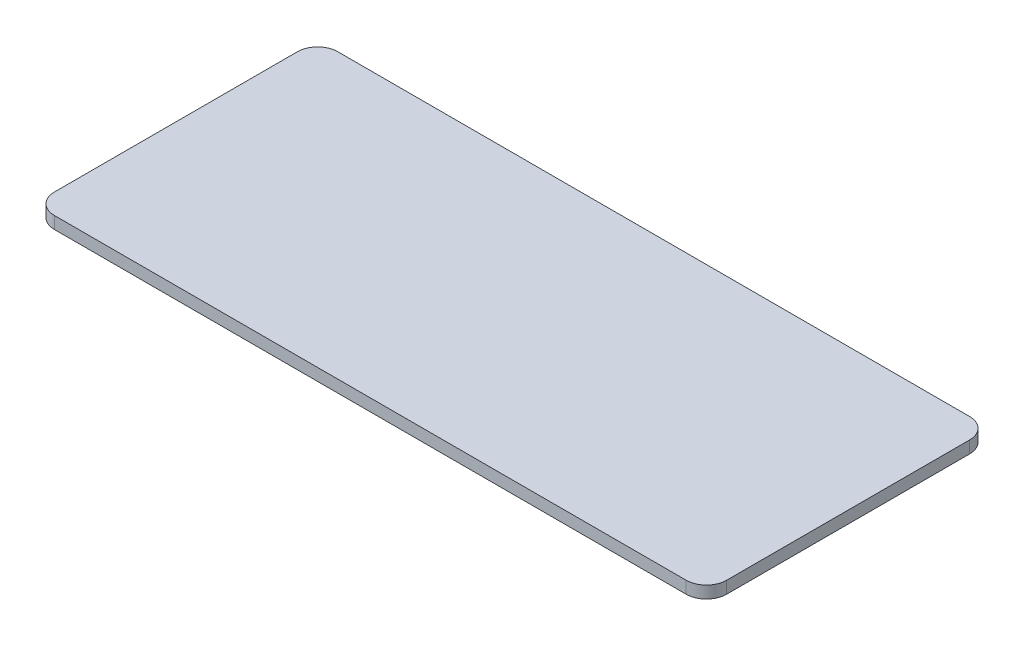
ISO-10303-21;
HEADER;
FILE_DESCRIPTION(('STEP AP214'),'2;1');
FILE_NAME('part.step','',(''),(''),'','','');
FILE_SCHEMA(('AUTOMOTIVE_DESIGN { 1 0 10303 214 1 1 1 1 }'));
ENDSEC;
DATA;
#1=APPLICATION_CONTEXT('core data for automotive mechanical design processes');
#2=APPLICATION_PROTOCOL_DEFINITION('international standard','automotive_design',2000,#1);
#3=PRODUCT_CONTEXT('',#1,'mechanical');
#4=PRODUCT('Part','Part','',(#3));
#5=PRODUCT_RELATED_PRODUCT_CATEGORY('part','',(#4));
#6=PRODUCT_DEFINITION_FORMATION('','',#4);
#7=PRODUCT_DEFINITION_CONTEXT('part definition',#1,'design');
#8=PRODUCT_DEFINITION('design','',#6,#7);
#9=PRODUCT_DEFINITION_SHAPE('','',#8);
#10=(LENGTH_UNIT() NAMED_UNIT(*) SI_UNIT(.MILLI.,.METRE.));
#11=(NAMED_UNIT(*) PLANE_ANGLE_UNIT() SI_UNIT($,.RADIAN.));
#12=(NAMED_UNIT(*) SI_UNIT($,.STERADIAN.) SOLID_ANGLE_UNIT());
#13=UNCERTAINTY_MEASURE_WITH_UNIT(LENGTH_MEASURE(1.E-05),#10,'distance_accuracy_value','');
#14=(GEOMETRIC_REPRESENTATION_CONTEXT(3) GLOBAL_UNCERTAINTY_ASSIGNED_CONTEXT((#13)) GLOBAL_UNIT_ASSIGNED_CONTEXT((#10,
#11,#12)) REPRESENTATION_CONTEXT('',''));
#15=CARTESIAN_POINT('',(0.,0.,0.));
#16=DIRECTION('',(0.,0.,1.));
#17=DIRECTION('',(1.,0.,0.));
#18=AXIS2_PLACEMENT_3D('',#15,#16,#17);
#19=CARTESIAN_POINT('',(0.,3.,0.));
#20=DIRECTION('',(0.,1.,0.));
#21=DIRECTION('',(0.,0.,1.));
#22=AXIS2_PLACEMENT_3D('',#19,#20,#21);
#23=PLANE('',#22);
#24=CARTESIAN_POINT('',(62.6371308016877,3.,-42.8481012658228));
#25=DIRECTION('',(0.,-1.,0.));
#26=DIRECTION('',(0.,0.,-1.));
#27=AXIS2_PLACEMENT_3D('',#24,#25,#26);
#28=CIRCLE('',#27,5.);
#29=CARTESIAN_POINT('',(67.6371308016878,3.,-42.8481012658228));
#30=VERTEX_POINT('',#29);
#31=CARTESIAN_POINT('',(62.6371308016877,3.,-47.8481012658228));
#32=VERTEX_POINT('',#31);
#33=EDGE_CURVE('E37',#30,#32,#28,.F.);
#34=ORIENTED_EDGE('',*,*,#33,.T.);
#35=DIRECTION('',(1.,0.,0.));
#36=VECTOR('',#35,1.);
#37=CARTESIAN_POINT('',(-98.3544303797468,3.,-47.8481012658228));
#38=LINE('',#37,#36);
#39=CARTESIAN_POINT('',(-93.3544303797468,3.,-47.8481012658228));
#40=VERTEX_POINT('',#39);
#41=EDGE_CURVE('E151',#40,#32,#38,.T.);
#42=ORIENTED_EDGE('',*,*,#41,.F.);
#43=CARTESIAN_POINT('',(-93.3544303797468,3.,-42.8481012658228));
#44=DIRECTION('',(0.,-1.,0.));
#45=DIRECTION('',(0.,0.,-1.));
#46=AXIS2_PLACEMENT_3D('',#43,#44,#45);
#47=CIRCLE('',#46,5.);
#48=CARTESIAN_POINT('',(-98.3544303797468,3.,-42.8481012658228));
#49=VERTEX_POINT('',#48);
#50=EDGE_CURVE('E156',#40,#49,#47,.F.);
#51=ORIENTED_EDGE('',*,*,#50,.T.);
#52=DIRECTION('',(0.,0.,-1.));
#53=VECTOR('',#52,1.);
#54=CARTESIAN_POINT('',(-98.3544303797468,3.,-47.8481012658228));
#55=LINE('',#54,#53);
#56=CARTESIAN_POINT('',(-98.3544303797468,3.,17.1518987341772));
#57=VERTEX_POINT('',#56);
#58=EDGE_CURVE('E106',#57,#49,#55,.T.);
#59=ORIENTED_EDGE('',*,*,#58,.F.);
#60=CARTESIAN_POINT('',(-93.3544303797468,3.,17.1518987341772));
#61=DIRECTION('',(0.,-1.,0.));
#62=DIRECTION('',(0.,0.,-1.));
#63=AXIS2_PLACEMENT_3D('',#60,#61,#62);
#64=CIRCLE('',#63,5.);
#65=CARTESIAN_POINT('',(-93.3544303797468,3.,22.1518987341772));
#66=VERTEX_POINT('',#65);
#67=EDGE_CURVE('E11',#57,#66,#64,.F.);
#68=ORIENTED_EDGE('',*,*,#67,.T.);
#69=DIRECTION('',(-1.,0.,0.));
#70=VECTOR('',#69,1.);
#71=CARTESIAN_POINT('',(-98.3544303797468,3.,22.1518987341772));
#72=LINE('',#71,#70);
#73=CARTESIAN_POINT('',(62.6371308016878,3.,22.1518987341772));
#74=VERTEX_POINT('',#73);
#75=EDGE_CURVE('E56',#74,#66,#72,.T.);
#76=ORIENTED_EDGE('',*,*,#75,.F.);
#77=CARTESIAN_POINT('',(62.6371308016878,3.,17.1518987341772));
#78=DIRECTION('',(0.,-1.,0.));
#79=DIRECTION('',(0.,0.,-1.));
#80=AXIS2_PLACEMENT_3D('',#77,#78,#79);
#81=CIRCLE('',#80,5.);
#82=CARTESIAN_POINT('',(67.6371308016878,3.,17.1518987341772));
#83=VERTEX_POINT('',#82);
#84=EDGE_CURVE('E42',#74,#83,#81,.F.);
#85=ORIENTED_EDGE('',*,*,#84,.T.);
#86=DIRECTION('',(0.,0.,1.));
#87=VECTOR('',#86,1.);
#88=CARTESIAN_POINT('',(67.6371308016878,3.,-47.8481012658228));
#89=LINE('',#88,#87);
#90=EDGE_CURVE('E154',#30,#83,#89,.T.);
#91=ORIENTED_EDGE('',*,*,#90,.F.);
#92=EDGE_LOOP('',(#34,#42,#51,#59,#68,#76,#85,#91));
#93=FACE_BOUND('',#92,.T.);
#94=ADVANCED_FACE('F33',(#93),#23,.T.);
#95=CARTESIAN_POINT('',(-98.3544303797468,50.,-47.8481012658228));
#96=DIRECTION('',(0.,0.,1.));
#97=DIRECTION('',(1.,0.,0.));
#98=AXIS2_PLACEMENT_3D('',#95,#96,#97);
#99=PLANE('',#98);
#100=DIRECTION('',(0.,-1.,0.));
#101=VECTOR('',#100,1.);
#102=CARTESIAN_POINT('',(-93.3544303797468,50.,-47.8481012658228));
#103=LINE('',#102,#101);
#104=CARTESIAN_POINT('',(-93.3544303797468,0.,-47.8481012658228));
#105=VERTEX_POINT('',#104);
#106=EDGE_CURVE('E116',#105,#40,#103,.F.);
#107=ORIENTED_EDGE('',*,*,#106,.T.);
#108=ORIENTED_EDGE('',*,*,#41,.T.);
#109=DIRECTION('',(0.,-1.,0.));
#110=VECTOR('',#109,1.);
#111=CARTESIAN_POINT('',(62.6371308016877,50.,-47.8481012658228));
#112=LINE('',#111,#110);
#113=CARTESIAN_POINT('',(62.6371308016877,0.,-47.8481012658228));
#114=VERTEX_POINT('',#113);
#115=EDGE_CURVE('E120',#32,#114,#112,.T.);
#116=ORIENTED_EDGE('',*,*,#115,.T.);
#117=DIRECTION('',(-1.,0.,0.));
#118=VECTOR('',#117,1.);
#119=CARTESIAN_POINT('',(-98.3544303797468,0.,-47.8481012658228));
#120=LINE('',#119,#118);
#121=EDGE_CURVE('E134',#114,#105,#120,.T.);
#122=ORIENTED_EDGE('',*,*,#121,.T.);
#123=EDGE_LOOP('',(#107,#108,#116,#122));
#124=FACE_BOUND('',#123,.T.);
#125=ADVANCED_FACE('F178',(#124),#99,.F.);
#126=CARTESIAN_POINT('',(67.6371308016878,50.,-47.8481012658228));
#127=DIRECTION('',(-1.,0.,0.));
#128=DIRECTION('',(0.,0.,1.));
#129=AXIS2_PLACEMENT_3D('',#126,#127,#128);
#130=PLANE('',#129);
#131=DIRECTION('',(0.,-1.,0.));
#132=VECTOR('',#131,1.);
#133=CARTESIAN_POINT('',(67.6371308016878,50.,-42.8481012658228));
#134=LINE('',#133,#132);
#135=CARTESIAN_POINT('',(67.6371308016878,0.,-42.8481012658228));
#136=VERTEX_POINT('',#135);
#137=EDGE_CURVE('E145',#136,#30,#134,.F.);
#138=ORIENTED_EDGE('',*,*,#137,.T.);
#139=ORIENTED_EDGE('',*,*,#90,.T.);
#140=DIRECTION('',(0.,-1.,0.));
#141=VECTOR('',#140,1.);
#142=CARTESIAN_POINT('',(67.6371308016878,50.,17.1518987341772));
#143=LINE('',#142,#141);
#144=CARTESIAN_POINT('',(67.6371308016878,0.,17.1518987341772));
#145=VERTEX_POINT('',#144);
#146=EDGE_CURVE('E143',#83,#145,#143,.T.);
#147=ORIENTED_EDGE('',*,*,#146,.T.);
#148=DIRECTION('',(0.,0.,-1.));
#149=VECTOR('',#148,1.);
#150=CARTESIAN_POINT('',(67.6371308016878,0.,-47.8481012658228));
#151=LINE('',#150,#149);
#152=EDGE_CURVE('E129',#145,#136,#151,.T.);
#153=ORIENTED_EDGE('',*,*,#152,.T.);
#154=EDGE_LOOP('',(#138,#139,#147,#153));
#155=FACE_BOUND('',#154,.T.);
#156=ADVANCED_FACE('F161',(#155),#130,.F.);
#157=CARTESIAN_POINT('',(-98.3544303797468,50.,22.1518987341772));
#158=DIRECTION('',(0.,0.,-1.));
#159=DIRECTION('',(-1.,0.,0.));
#160=AXIS2_PLACEMENT_3D('',#157,#158,#159);
#161=PLANE('',#160);
#162=DIRECTION('',(0.,-1.,0.));
#163=VECTOR('',#162,1.);
#164=CARTESIAN_POINT('',(62.6371308016878,50.,22.1518987341772));
#165=LINE('',#164,#163);
#166=CARTESIAN_POINT('',(62.6371308016878,0.,22.1518987341772));
#167=VERTEX_POINT('',#166);
#168=EDGE_CURVE('E150',#167,#74,#165,.F.);
#169=ORIENTED_EDGE('',*,*,#168,.T.);
#170=ORIENTED_EDGE('',*,*,#75,.T.);
#171=DIRECTION('',(0.,-1.,0.));
#172=VECTOR('',#171,1.);
#173=CARTESIAN_POINT('',(-93.3544303797468,50.,22.1518987341772));
#174=LINE('',#173,#172);
#175=CARTESIAN_POINT('',(-93.3544303797468,0.,22.1518987341772));
#176=VERTEX_POINT('',#175);
#177=EDGE_CURVE('E148',#66,#176,#174,.T.);
#178=ORIENTED_EDGE('',*,*,#177,.T.);
#179=DIRECTION('',(1.,0.,0.));
#180=VECTOR('',#179,1.);
#181=CARTESIAN_POINT('',(-98.3544303797468,0.,22.1518987341772));
#182=LINE('',#181,#180);
#183=EDGE_CURVE('E126',#176,#167,#182,.T.);
#184=ORIENTED_EDGE('',*,*,#183,.T.);
#185=EDGE_LOOP('',(#169,#170,#178,#184));
#186=FACE_BOUND('',#185,.T.);
#187=ADVANCED_FACE('F185',(#186),#161,.F.);
#188=CARTESIAN_POINT('',(0.,0.,0.));
#189=DIRECTION('',(0.,1.,0.));
#190=DIRECTION('',(0.,0.,1.));
#191=AXIS2_PLACEMENT_3D('',#188,#189,#190);
#192=PLANE('',#191);
#193=DIRECTION('',(0.,0.,1.));
#194=VECTOR('',#193,1.);
#195=CARTESIAN_POINT('',(-98.3544303797468,0.,-47.8481012658228));
#196=LINE('',#195,#194);
#197=CARTESIAN_POINT('',(-98.3544303797468,0.,-42.8481012658228));
#198=VERTEX_POINT('',#197);
#199=CARTESIAN_POINT('',(-98.3544303797468,0.,17.1518987341772));
#200=VERTEX_POINT('',#199);
#201=EDGE_CURVE('E105',#198,#200,#196,.T.);
#202=ORIENTED_EDGE('',*,*,#201,.F.);
#203=CARTESIAN_POINT('',(-93.3544303797468,0.,-42.8481012658228));
#204=DIRECTION('',(0.,1.,0.));
#205=DIRECTION('',(0.,0.,1.));
#206=AXIS2_PLACEMENT_3D('',#203,#204,#205);
#207=CIRCLE('',#206,5.);
#208=EDGE_CURVE('E113',#198,#105,#207,.F.);
#209=ORIENTED_EDGE('',*,*,#208,.T.);
#210=ORIENTED_EDGE('',*,*,#121,.F.);
#211=CARTESIAN_POINT('',(62.6371308016877,0.,-42.8481012658228));
#212=DIRECTION('',(0.,1.,0.));
#213=DIRECTION('',(0.,0.,1.));
#214=AXIS2_PLACEMENT_3D('',#211,#212,#213);
#215=CIRCLE('',#214,5.);
#216=EDGE_CURVE('E121',#114,#136,#215,.F.);
#217=ORIENTED_EDGE('',*,*,#216,.T.);
#218=ORIENTED_EDGE('',*,*,#152,.F.);
#219=CARTESIAN_POINT('',(62.6371308016878,0.,17.1518987341772));
#220=DIRECTION('',(0.,1.,0.));
#221=DIRECTION('',(0.,0.,1.));
#222=AXIS2_PLACEMENT_3D('',#219,#220,#221);
#223=CIRCLE('',#222,5.);
#224=EDGE_CURVE('E138',#145,#167,#223,.F.);
#225=ORIENTED_EDGE('',*,*,#224,.T.);
#226=ORIENTED_EDGE('',*,*,#183,.F.);
#227=CARTESIAN_POINT('',(-93.3544303797468,0.,17.1518987341772));
#228=DIRECTION('',(0.,1.,0.));
#229=DIRECTION('',(0.,0.,1.));
#230=AXIS2_PLACEMENT_3D('',#227,#228,#229);
#231=CIRCLE('',#230,5.);
#232=EDGE_CURVE('E109',#176,#200,#231,.F.);
#233=ORIENTED_EDGE('',*,*,#232,.T.);
#234=EDGE_LOOP('',(#202,#209,#210,#217,#218,#225,#226,#233));
#235=FACE_BOUND('',#234,.T.);
#236=ADVANCED_FACE('F123',(#235),#192,.F.);
#237=CARTESIAN_POINT('',(-98.3544303797468,50.,-47.8481012658228));
#238=DIRECTION('',(1.,0.,0.));
#239=DIRECTION('',(0.,0.,-1.));
#240=AXIS2_PLACEMENT_3D('',#237,#238,#239);
#241=PLANE('',#240);
#242=DIRECTION('',(0.,-1.,0.));
#243=VECTOR('',#242,1.);
#244=CARTESIAN_POINT('',(-98.3544303797468,50.,17.1518987341772));
#245=LINE('',#244,#243);
#246=EDGE_CURVE('E110',#200,#57,#245,.F.);
#247=ORIENTED_EDGE('',*,*,#246,.T.);
#248=ORIENTED_EDGE('',*,*,#58,.T.);
#249=DIRECTION('',(0.,-1.,0.));
#250=VECTOR('',#249,1.);
#251=CARTESIAN_POINT('',(-98.3544303797468,50.,-42.8481012658228));
#252=LINE('',#251,#250);
#253=EDGE_CURVE('E100',#49,#198,#252,.T.);
#254=ORIENTED_EDGE('',*,*,#253,.T.);
#255=ORIENTED_EDGE('',*,*,#201,.T.);
#256=EDGE_LOOP('',(#247,#248,#254,#255));
#257=FACE_BOUND('',#256,.T.);
#258=ADVANCED_FACE('F103',(#257),#241,.F.);
#259=CARTESIAN_POINT('',(-93.3544303797468,50.,17.1518987341772));
#260=DIRECTION('',(0.,-1.,0.));
#261=DIRECTION('',(0.,0.,-1.));
#262=AXIS2_PLACEMENT_3D('',#259,#260,#261);
#263=CYLINDRICAL_SURFACE('',#262,5.);
#264=ORIENTED_EDGE('',*,*,#67,.F.);
#265=ORIENTED_EDGE('',*,*,#246,.F.);
#266=ORIENTED_EDGE('',*,*,#232,.F.);
#267=ORIENTED_EDGE('',*,*,#177,.F.);
#268=EDGE_LOOP('',(#264,#265,#266,#267));
#269=FACE_BOUND('',#268,.T.);
#270=ADVANCED_FACE('F35',(#269),#263,.T.);
#271=CARTESIAN_POINT('',(62.6371308016878,50.,17.1518987341772));
#272=DIRECTION('',(0.,-1.,0.));
#273=DIRECTION('',(0.,0.,-1.));
#274=AXIS2_PLACEMENT_3D('',#271,#272,#273);
#275=CYLINDRICAL_SURFACE('',#274,5.);
#276=ORIENTED_EDGE('',*,*,#84,.F.);
#277=ORIENTED_EDGE('',*,*,#168,.F.);
#278=ORIENTED_EDGE('',*,*,#224,.F.);
#279=ORIENTED_EDGE('',*,*,#146,.F.);
#280=EDGE_LOOP('',(#276,#277,#278,#279));
#281=FACE_BOUND('',#280,.T.);
#282=ADVANCED_FACE('F170',(#281),#275,.T.);
#283=CARTESIAN_POINT('',(62.6371308016877,50.,-42.8481012658228));
#284=DIRECTION('',(0.,-1.,0.));
#285=DIRECTION('',(0.,0.,-1.));
#286=AXIS2_PLACEMENT_3D('',#283,#284,#285);
#287=CYLINDRICAL_SURFACE('',#286,5.);
#288=ORIENTED_EDGE('',*,*,#33,.F.);
#289=ORIENTED_EDGE('',*,*,#137,.F.);
#290=ORIENTED_EDGE('',*,*,#216,.F.);
#291=ORIENTED_EDGE('',*,*,#115,.F.);
#292=EDGE_LOOP('',(#288,#289,#290,#291));
#293=FACE_BOUND('',#292,.T.);
#294=ADVANCED_FACE('F174',(#293),#287,.T.);
#295=CARTESIAN_POINT('',(-93.3544303797468,50.,-42.8481012658228));
#296=DIRECTION('',(0.,-1.,0.));
#297=DIRECTION('',(0.,0.,-1.));
#298=AXIS2_PLACEMENT_3D('',#295,#296,#297);
#299=CYLINDRICAL_SURFACE('',#298,5.);
#300=ORIENTED_EDGE('',*,*,#50,.F.);
#301=ORIENTED_EDGE('',*,*,#106,.F.);
#302=ORIENTED_EDGE('',*,*,#208,.F.);
#303=ORIENTED_EDGE('',*,*,#253,.F.);
#304=EDGE_LOOP('',(#300,#301,#302,#303));
#305=FACE_BOUND('',#304,.T.);
#306=ADVANCED_FACE('F114',(#305),#299,.T.);
#307=CLOSED_SHELL('',(#94,#125,#156,#187,#236,#258,#270,#282,#294,#306));
#308=MANIFOLD_SOLID_BREP('B2',#307);
#309=ADVANCED_BREP_SHAPE_REPRESENTATION('',(#18,#308),#14);
#310=SHAPE_DEFINITION_REPRESENTATION(#9,#309);
ENDSEC;
END-ISO-10303-21;
